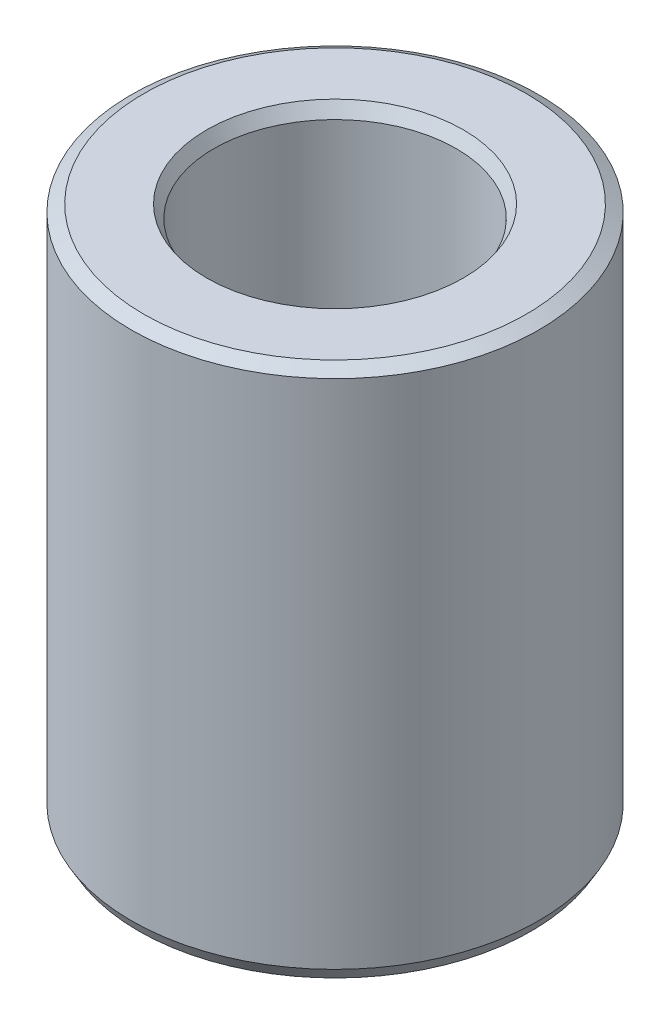
ISO-10303-21;
HEADER;
FILE_DESCRIPTION(('STEP AP214'),'2;1');
FILE_NAME('part.step','',(''),(''),'','','');
FILE_SCHEMA(('AUTOMOTIVE_DESIGN { 1 0 10303 214 1 1 1 1 }'));
ENDSEC;
DATA;
#1=APPLICATION_CONTEXT('core data for automotive mechanical design processes');
#2=APPLICATION_PROTOCOL_DEFINITION('international standard','automotive_design',2000,#1);
#3=PRODUCT_CONTEXT('',#1,'mechanical');
#4=PRODUCT('Part','Part','',(#3));
#5=PRODUCT_RELATED_PRODUCT_CATEGORY('part','',(#4));
#6=PRODUCT_DEFINITION_FORMATION('','',#4);
#7=PRODUCT_DEFINITION_CONTEXT('part definition',#1,'design');
#8=PRODUCT_DEFINITION('design','',#6,#7);
#9=PRODUCT_DEFINITION_SHAPE('','',#8);
#10=(LENGTH_UNIT() NAMED_UNIT(*) SI_UNIT(.MILLI.,.METRE.));
#11=(NAMED_UNIT(*) PLANE_ANGLE_UNIT() SI_UNIT($,.RADIAN.));
#12=(NAMED_UNIT(*) SI_UNIT($,.STERADIAN.) SOLID_ANGLE_UNIT());
#13=UNCERTAINTY_MEASURE_WITH_UNIT(LENGTH_MEASURE(1.E-05),#10,'distance_accuracy_value','');
#14=(GEOMETRIC_REPRESENTATION_CONTEXT(3) GLOBAL_UNCERTAINTY_ASSIGNED_CONTEXT((#13)) GLOBAL_UNIT_ASSIGNED_CONTEXT((#10,
#11,#12)) REPRESENTATION_CONTEXT('',''));
#15=CARTESIAN_POINT('',(0.,0.,0.));
#16=DIRECTION('',(0.,0.,1.));
#17=DIRECTION('',(1.,0.,0.));
#18=AXIS2_PLACEMENT_3D('',#15,#16,#17);
#19=CARTESIAN_POINT('',(0.,156.482173438654,0.));
#20=DIRECTION('',(0.,-1.,0.));
#21=DIRECTION('',(0.,0.,-1.));
#22=AXIS2_PLACEMENT_3D('',#19,#20,#21);
#23=CYLINDRICAL_SURFACE('',#22,60.);
#24=CARTESIAN_POINT('',(0.,3.70441484600659,0.));
#25=DIRECTION('',(0.,1.,0.));
#26=DIRECTION('',(0.,0.,1.));
#27=AXIS2_PLACEMENT_3D('',#24,#25,#26);
#28=CIRCLE('',#27,60.);
#29=CARTESIAN_POINT('',(0.,3.70441484600659,60.));
#30=VERTEX_POINT('',#29);
#31=EDGE_CURVE('E10',#30,#30,#28,.T.);
#32=ORIENTED_EDGE('',*,*,#31,.T.);
#33=EDGE_LOOP('',(#32));
#34=FACE_BOUND('',#33,.T.);
#35=CARTESIAN_POINT('',(0.,154.343428530122,0.));
#36=DIRECTION('',(0.,1.,0.));
#37=DIRECTION('',(0.,0.,1.));
#38=AXIS2_PLACEMENT_3D('',#35,#36,#37);
#39=CIRCLE('',#38,60.);
#40=CARTESIAN_POINT('',(0.,154.343428530122,60.));
#41=VERTEX_POINT('',#40);
#42=EDGE_CURVE('E50',#41,#41,#39,.F.);
#43=ORIENTED_EDGE('',*,*,#42,.T.);
#44=EDGE_LOOP('',(#43));
#45=FACE_BOUND('',#44,.T.);
#46=ADVANCED_FACE('F39',(#34,#45),#23,.T.);
#47=CARTESIAN_POINT('',(0.,156.482173438654,0.));
#48=DIRECTION('',(0.,1.,0.));
#49=DIRECTION('',(0.,0.,1.));
#50=AXIS2_PLACEMENT_3D('',#47,#48,#49);
#51=PLANE('',#50);
#52=CARTESIAN_POINT('',(0.,156.482173438654,0.));
#53=DIRECTION('',(0.,1.,0.));
#54=DIRECTION('',(0.,0.,1.));
#55=AXIS2_PLACEMENT_3D('',#52,#53,#54);
#56=CIRCLE('',#55,37.8023861851678);
#57=CARTESIAN_POINT('',(0.,156.482173438654,37.8023861851678));
#58=VERTEX_POINT('',#57);
#59=EDGE_CURVE('E58',#58,#58,#56,.F.);
#60=ORIENTED_EDGE('',*,*,#59,.T.);
#61=EDGE_LOOP('',(#60));
#62=FACE_BOUND('',#61,.T.);
#63=CARTESIAN_POINT('',(0.,156.482173438654,0.));
#64=DIRECTION('',(0.,1.,0.));
#65=DIRECTION('',(0.,0.,1.));
#66=AXIS2_PLACEMENT_3D('',#63,#64,#65);
#67=CIRCLE('',#66,56.2955851539933);
#68=CARTESIAN_POINT('',(0.,156.482173438654,56.2955851539933));
#69=VERTEX_POINT('',#68);
#70=EDGE_CURVE('E61',#69,#69,#67,.T.);
#71=ORIENTED_EDGE('',*,*,#70,.T.);
#72=EDGE_LOOP('',(#71));
#73=FACE_BOUND('',#72,.T.);
#74=ADVANCED_FACE('F88',(#62,#73),#51,.T.);
#75=CARTESIAN_POINT('',(0.,0.,0.));
#76=DIRECTION('',(0.,1.,0.));
#77=DIRECTION('',(0.,0.,1.));
#78=AXIS2_PLACEMENT_3D('',#75,#76,#77);
#79=PLANE('',#78);
#80=CARTESIAN_POINT('',(0.,0.,0.));
#81=DIRECTION('',(0.,1.,0.));
#82=DIRECTION('',(0.,0.,1.));
#83=AXIS2_PLACEMENT_3D('',#80,#81,#82);
#84=CIRCLE('',#83,39.3680561226424);
#85=CARTESIAN_POINT('',(0.,0.,39.3680561226424));
#86=VERTEX_POINT('',#85);
#87=EDGE_CURVE('E51',#86,#86,#84,.T.);
#88=ORIENTED_EDGE('',*,*,#87,.T.);
#89=EDGE_LOOP('',(#88));
#90=FACE_BOUND('',#89,.T.);
#91=CARTESIAN_POINT('',(0.,0.,0.));
#92=DIRECTION('',(0.,1.,0.));
#93=DIRECTION('',(0.,0.,1.));
#94=AXIS2_PLACEMENT_3D('',#91,#92,#93);
#95=CIRCLE('',#94,57.861255091468);
#96=CARTESIAN_POINT('',(0.,0.,57.861255091468));
#97=VERTEX_POINT('',#96);
#98=EDGE_CURVE('E54',#97,#97,#95,.F.);
#99=ORIENTED_EDGE('',*,*,#98,.T.);
#100=EDGE_LOOP('',(#99));
#101=FACE_BOUND('',#100,.T.);
#102=ADVANCED_FACE('F83',(#90,#101),#79,.F.);
#103=CARTESIAN_POINT('',(0.,156.482173438654,0.));
#104=DIRECTION('',(0.,-1.,0.));
#105=DIRECTION('',(0.,0.,-1.));
#106=AXIS2_PLACEMENT_3D('',#103,#104,#105);
#107=CYLINDRICAL_SURFACE('',#106,35.6636412766358);
#108=CARTESIAN_POINT('',(0.,152.777758592647,0.));
#109=DIRECTION('',(0.,1.,0.));
#110=DIRECTION('',(0.,0.,1.));
#111=AXIS2_PLACEMENT_3D('',#108,#109,#110);
#112=CIRCLE('',#111,35.6636412766358);
#113=CARTESIAN_POINT('',(0.,152.777758592647,35.6636412766358));
#114=VERTEX_POINT('',#113);
#115=EDGE_CURVE('E67',#114,#114,#112,.T.);
#116=ORIENTED_EDGE('',*,*,#115,.T.);
#117=EDGE_LOOP('',(#116));
#118=FACE_BOUND('',#117,.T.);
#119=CARTESIAN_POINT('',(0.,2.138744908532,0.));
#120=DIRECTION('',(0.,1.,0.));
#121=DIRECTION('',(0.,0.,1.));
#122=AXIS2_PLACEMENT_3D('',#119,#120,#121);
#123=CIRCLE('',#122,35.6636412766358);
#124=CARTESIAN_POINT('',(0.,2.138744908532,35.6636412766358));
#125=VERTEX_POINT('',#124);
#126=EDGE_CURVE('E69',#125,#125,#123,.F.);
#127=ORIENTED_EDGE('',*,*,#126,.T.);
#128=EDGE_LOOP('',(#127));
#129=FACE_BOUND('',#128,.T.);
#130=ADVANCED_FACE('F71',(#118,#129),#107,.F.);
#131=CARTESIAN_POINT('',(0.,152.777758592647,0.));
#132=DIRECTION('',(0.,1.,0.));
#133=DIRECTION('',(0.,0.,1.));
#134=AXIS2_PLACEMENT_3D('',#131,#132,#133);
#135=CONICAL_SURFACE('',#134,35.6636412766358,0.523598775598298);
#136=ORIENTED_EDGE('',*,*,#59,.F.);
#137=EDGE_LOOP('',(#136));
#138=FACE_BOUND('',#137,.T.);
#139=ORIENTED_EDGE('',*,*,#115,.F.);
#140=EDGE_LOOP('',(#139));
#141=FACE_BOUND('',#140,.T.);
#142=ADVANCED_FACE('F77',(#138,#141),#135,.F.);
#143=CARTESIAN_POINT('',(0.,0.,0.));
#144=DIRECTION('',(0.,-1.,0.));
#145=DIRECTION('',(0.,0.,-1.));
#146=AXIS2_PLACEMENT_3D('',#143,#144,#145);
#147=CONICAL_SURFACE('',#146,39.3680561226424,1.04719755119659);
#148=ORIENTED_EDGE('',*,*,#126,.F.);
#149=EDGE_LOOP('',(#148));
#150=FACE_BOUND('',#149,.T.);
#151=ORIENTED_EDGE('',*,*,#87,.F.);
#152=EDGE_LOOP('',(#151));
#153=FACE_BOUND('',#152,.T.);
#154=ADVANCED_FACE('F73',(#150,#153),#147,.F.);
#155=CARTESIAN_POINT('',(0.,3.70441484600659,0.));
#156=DIRECTION('',(0.,1.,0.));
#157=DIRECTION('',(0.,0.,1.));
#158=AXIS2_PLACEMENT_3D('',#155,#156,#157);
#159=CONICAL_SURFACE('',#158,60.,0.523598775598304);
#160=CARTESIAN_POINT('',(0.,0.,57.861255091468));
#161=CARTESIAN_POINT('',(0.,0.0385876546459017,57.8835336842652));
#162=CARTESIAN_POINT('',(0.,0.0771753092918036,57.9058122770624));
#163=CARTESIAN_POINT('',(0.,0.154350618583607,57.9503694626569));
#164=CARTESIAN_POINT('',(0.,0.192938273229509,57.9726480554541));
#165=CARTESIAN_POINT('',(0.,0.270113582521313,58.0172052410485));
#166=CARTESIAN_POINT('',(0.,0.308701237167216,58.0394838338457));
#167=CARTESIAN_POINT('',(0.,0.385876546459019,58.0840410194401));
#168=CARTESIAN_POINT('',(0.,0.424464201104921,58.1063196122373));
#169=CARTESIAN_POINT('',(0.,0.501639510396724,58.1508767978317));
#170=CARTESIAN_POINT('',(0.,0.540227165042627,58.1731553906289));
#171=CARTESIAN_POINT('',(0.,0.617402474334431,58.2177125762233));
#172=CARTESIAN_POINT('',(0.,0.655990128980333,58.2399911690206));
#173=CARTESIAN_POINT('',(0.,0.733165438272137,58.284548354615));
#174=CARTESIAN_POINT('',(0.,0.771753092918039,58.3068269474122));
#175=CARTESIAN_POINT('',(0.,0.848928402209843,58.3513841330066));
#176=CARTESIAN_POINT('',(0.,0.887516056855745,58.3736627258038));
#177=CARTESIAN_POINT('',(0.,0.964691366147548,58.4182199113982));
#178=CARTESIAN_POINT('',(0.,1.00327902079345,58.4404985041954));
#179=CARTESIAN_POINT('',(0.,1.08045433008525,58.4850556897898));
#180=CARTESIAN_POINT('',(0.,1.11904198473116,58.5073342825871));
#181=CARTESIAN_POINT('',(0.,1.19621729402296,58.5518914681815));
#182=CARTESIAN_POINT('',(0.,1.23480494866886,58.5741700609787));
#183=CARTESIAN_POINT('',(0.,1.31198025796067,58.6187272465731));
#184=CARTESIAN_POINT('',(0.,1.35056791260657,58.6410058393703));
#185=CARTESIAN_POINT('',(0.,1.42774322189837,58.6855630249647));
#186=CARTESIAN_POINT('',(0.,1.46633087654427,58.7078416177619));
#187=CARTESIAN_POINT('',(0.,1.54350618583608,58.7523988033563));
#188=CARTESIAN_POINT('',(0.,1.58209384048198,58.7746773961535));
#189=CARTESIAN_POINT('',(0.,1.65926914977378,58.819234581748));
#190=CARTESIAN_POINT('',(0.,1.69785680441969,58.8415131745452));
#191=CARTESIAN_POINT('',(0.,1.77503211371149,58.8860703601396));
#192=CARTESIAN_POINT('',(0.,1.81361976835739,58.9083489529368));
#193=CARTESIAN_POINT('',(0.,1.8907950776492,58.9529061385312));
#194=CARTESIAN_POINT('',(0.,1.9293827322951,58.9751847313284));
#195=CARTESIAN_POINT('',(0.,2.0065580415869,59.0197419169228));
#196=CARTESIAN_POINT('',(0.,2.0451456962328,59.0420205097201));
#197=CARTESIAN_POINT('',(0.,2.12232100552461,59.0865776953145));
#198=CARTESIAN_POINT('',(0.,2.16090866017051,59.1088562881117));
#199=CARTESIAN_POINT('',(0.,2.23808396946231,59.1534134737061));
#200=CARTESIAN_POINT('',(0.,2.27667162410822,59.1756920665033));
#201=CARTESIAN_POINT('',(0.,2.35384693340002,59.2202492520977));
#202=CARTESIAN_POINT('',(0.,2.39243458804592,59.2425278448949));
#203=CARTESIAN_POINT('',(0.,2.46960989733773,59.2870850304893));
#204=CARTESIAN_POINT('',(0.,2.50819755198363,59.3093636232865));
#205=CARTESIAN_POINT('',(0.,2.58537286127543,59.353920808881));
#206=CARTESIAN_POINT('',(0.,2.62396051592133,59.3761994016782));
#207=CARTESIAN_POINT('',(0.,2.70113582521314,59.4207565872726));
#208=CARTESIAN_POINT('',(0.,2.73972347985904,59.4430351800698));
#209=CARTESIAN_POINT('',(0.,2.81689878915084,59.4875923656642));
#210=CARTESIAN_POINT('',(0.,2.85548644379674,59.5098709584614));
#211=CARTESIAN_POINT('',(0.,2.93266175308855,59.5544281440558));
#212=CARTESIAN_POINT('',(0.,2.97124940773445,59.576706736853));
#213=CARTESIAN_POINT('',(0.,3.04842471702625,59.6212639224475));
#214=CARTESIAN_POINT('',(0.,3.08701237167216,59.6435425152447));
#215=CARTESIAN_POINT('',(0.,3.16418768096396,59.6880997008391));
#216=CARTESIAN_POINT('',(0.,3.20277533560986,59.7103782936363));
#217=CARTESIAN_POINT('',(0.,3.27995064490167,59.7549354792307));
#218=CARTESIAN_POINT('',(0.,3.31853829954757,59.7772140720279));
#219=CARTESIAN_POINT('',(0.,3.39571360883937,59.8217712576223));
#220=CARTESIAN_POINT('',(0.,3.43430126348527,59.8440498504195));
#221=CARTESIAN_POINT('',(0.,3.51147657277708,59.888607036014));
#222=CARTESIAN_POINT('',(0.,3.55006422742298,59.9108856288112));
#223=CARTESIAN_POINT('',(0.,3.62723953671478,59.9554428144056));
#224=CARTESIAN_POINT('',(0.,3.66582719136069,59.9777214072028));
#225=CARTESIAN_POINT('',(0.,3.70441484600659,60.));
#226=B_SPLINE_CURVE_WITH_KNOTS('',3,(#160,#161,#162,#163,#164,#165,#166,#167,#168,#169,#170,
#171,#172,#173,#174,#175,#176,#177,#178,#179,#180,#181,#182,#183,#184,#185,#186,#187,#188,#189,
#190,#191,#192,#193,#194,#195,#196,#197,#198,#199,#200,#201,#202,#203,#204,#205,#206,#207,#208,
#209,#210,#211,#212,#213,#214,#215,#216,#217,#218,#219,#220,#221,#222,#223,#224,#225),
.UNSPECIFIED.,.F.,.F.,(4,2,2,2,2,2,2,2,2,2,2,2,2,2,2,2,2,2,2,2,2,2,2,2,2,2,2,2,2,2,2,2,4),(0.,
0.133671556783247,0.267343113566493,0.40101467034974,0.53468622713299,0.668357783916237,
0.802029340699484,0.93570089748273,1.06937245426598,1.20304401104922,1.33671556783247,
1.47038712461572,1.60405868139897,1.73773023818221,1.87140179496546,2.00507335174871,
2.13874490853195,2.27241646531521,2.40608802209845,2.5397595788817,2.67343113566495,
2.80710269244819,2.94077424923144,3.07444580601469,3.20811736279794,3.34178891958118,
3.47546047636443,3.60913203314768,3.74280358993092,3.87647514671417,4.01014670349742,
4.14381826028067,4.27748981706391),.UNSPECIFIED.);
#227=EDGE_CURVE('BSEAM76',#97,#30,#226,.T.);
#228=ORIENTED_EDGE('',*,*,#98,.F.);
#229=ORIENTED_EDGE('',*,*,#31,.F.);
#230=ORIENTED_EDGE('',*,*,#227,.T.);
#231=ORIENTED_EDGE('',*,*,#227,.F.);
#232=EDGE_LOOP('',(#228,#230,#229,#231));
#233=FACE_BOUND('',#232,.T.);
#234=ADVANCED_FACE('F76',(#233),#159,.T.);
#235=CARTESIAN_POINT('',(0.,156.482173438654,0.));
#236=DIRECTION('',(0.,-1.,0.));
#237=DIRECTION('',(0.,0.,-1.));
#238=AXIS2_PLACEMENT_3D('',#235,#236,#237);
#239=CONICAL_SURFACE('',#238,56.2955851539933,1.0471975511966);
#240=ORIENTED_EDGE('',*,*,#42,.F.);
#241=EDGE_LOOP('',(#240));
#242=FACE_BOUND('',#241,.T.);
#243=ORIENTED_EDGE('',*,*,#70,.F.);
#244=EDGE_LOOP('',(#243));
#245=FACE_BOUND('',#244,.T.);
#246=ADVANCED_FACE('F45',(#242,#245),#239,.T.);
#247=CLOSED_SHELL('',(#46,#74,#102,#130,#142,#154,#234,#246));
#248=MANIFOLD_SOLID_BREP('B2',#247);
#249=ADVANCED_BREP_SHAPE_REPRESENTATION('',(#18,#248),#14);
#250=SHAPE_DEFINITION_REPRESENTATION(#9,#249);
ENDSEC;
END-ISO-10303-21;
